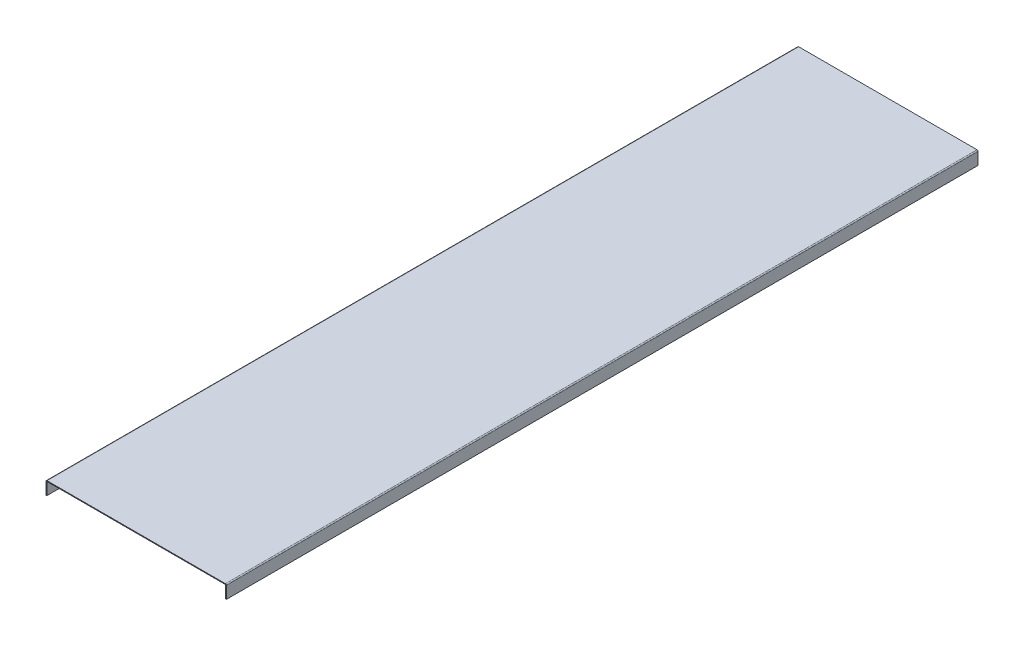
ISO-10303-21;
HEADER;
FILE_DESCRIPTION(('STEP AP214'),'2;1');
FILE_NAME('part.step','',(''),(''),'','','');
FILE_SCHEMA(('AUTOMOTIVE_DESIGN { 1 0 10303 214 1 1 1 1 }'));
ENDSEC;
DATA;
#1=APPLICATION_CONTEXT('core data for automotive mechanical design processes');
#2=APPLICATION_PROTOCOL_DEFINITION('international standard','automotive_design',2000,#1);
#3=PRODUCT_CONTEXT('',#1,'mechanical');
#4=PRODUCT('Part','Part','',(#3));
#5=PRODUCT_RELATED_PRODUCT_CATEGORY('part','',(#4));
#6=PRODUCT_DEFINITION_FORMATION('','',#4);
#7=PRODUCT_DEFINITION_CONTEXT('part definition',#1,'design');
#8=PRODUCT_DEFINITION('design','',#6,#7);
#9=PRODUCT_DEFINITION_SHAPE('','',#8);
#10=(LENGTH_UNIT() NAMED_UNIT(*) SI_UNIT(.MILLI.,.METRE.));
#11=(NAMED_UNIT(*) PLANE_ANGLE_UNIT() SI_UNIT($,.RADIAN.));
#12=(NAMED_UNIT(*) SI_UNIT($,.STERADIAN.) SOLID_ANGLE_UNIT());
#13=UNCERTAINTY_MEASURE_WITH_UNIT(LENGTH_MEASURE(1.E-05),#10,'distance_accuracy_value','');
#14=(GEOMETRIC_REPRESENTATION_CONTEXT(3) GLOBAL_UNCERTAINTY_ASSIGNED_CONTEXT((#13)) GLOBAL_UNIT_ASSIGNED_CONTEXT((#10,
#11,#12)) REPRESENTATION_CONTEXT('',''));
#15=CARTESIAN_POINT('',(0.,0.,0.));
#16=DIRECTION('',(0.,0.,1.));
#17=DIRECTION('',(1.,0.,0.));
#18=AXIS2_PLACEMENT_3D('',#15,#16,#17);
#19=CARTESIAN_POINT('',(-240.,-2.,2000.));
#20=DIRECTION('',(0.,1.,0.));
#21=DIRECTION('',(0.,0.,1.));
#22=AXIS2_PLACEMENT_3D('',#19,#20,#21);
#23=PLANE('',#22);
#24=DIRECTION('',(0.,0.,-1.));
#25=VECTOR('',#24,1.);
#26=CARTESIAN_POINT('',(-237.2634,-2.00000000000002,0.));
#27=LINE('',#26,#25);
#28=CARTESIAN_POINT('',(-237.2634,-2.00000000000002,0.));
#29=VERTEX_POINT('',#28);
#30=CARTESIAN_POINT('',(-237.2634,-2.00000000000002,2000.));
#31=VERTEX_POINT('',#30);
#32=EDGE_CURVE('E224',#29,#31,#27,.F.);
#33=ORIENTED_EDGE('',*,*,#32,.F.);
#34=DIRECTION('',(1.,0.,0.));
#35=VECTOR('',#34,1.);
#36=CARTESIAN_POINT('',(-240.,-2.,0.));
#37=LINE('',#36,#35);
#38=CARTESIAN_POINT('',(237.2634,-1.99999999999999,0.));
#39=VERTEX_POINT('',#38);
#40=EDGE_CURVE('E282',#29,#39,#37,.T.);
#41=ORIENTED_EDGE('',*,*,#40,.T.);
#42=DIRECTION('',(0.,0.,1.));
#43=VECTOR('',#42,1.);
#44=CARTESIAN_POINT('',(237.2634,-1.99999999999999,2000.));
#45=LINE('',#44,#43);
#46=CARTESIAN_POINT('',(237.2634,-1.99999999999999,2000.));
#47=VERTEX_POINT('',#46);
#48=EDGE_CURVE('E276',#47,#39,#45,.F.);
#49=ORIENTED_EDGE('',*,*,#48,.F.);
#50=DIRECTION('',(1.,0.,0.));
#51=VECTOR('',#50,1.);
#52=CARTESIAN_POINT('',(-240.,-2.,2000.));
#53=LINE('',#52,#51);
#54=EDGE_CURVE('E87',#31,#47,#53,.T.);
#55=ORIENTED_EDGE('',*,*,#54,.F.);
#56=EDGE_LOOP('',(#33,#41,#49,#55));
#57=FACE_BOUND('',#56,.T.);
#58=ADVANCED_FACE('F79',(#57),#23,.F.);
#59=CARTESIAN_POINT('',(-240.,0.,2000.));
#60=DIRECTION('',(0.,1.,0.));
#61=DIRECTION('',(0.,0.,1.));
#62=AXIS2_PLACEMENT_3D('',#59,#60,#61);
#63=PLANE('',#62);
#64=DIRECTION('',(1.,0.,0.));
#65=VECTOR('',#64,1.);
#66=CARTESIAN_POINT('',(-240.,0.,0.));
#67=LINE('',#66,#65);
#68=CARTESIAN_POINT('',(-237.2634,0.,0.));
#69=VERTEX_POINT('',#68);
#70=CARTESIAN_POINT('',(237.2634,0.,0.));
#71=VERTEX_POINT('',#70);
#72=EDGE_CURVE('E82',#69,#71,#67,.T.);
#73=ORIENTED_EDGE('',*,*,#72,.F.);
#74=DIRECTION('',(0.,0.,-1.));
#75=VECTOR('',#74,1.);
#76=CARTESIAN_POINT('',(-237.2634,0.,0.));
#77=LINE('',#76,#75);
#78=CARTESIAN_POINT('',(-237.2634,0.,2000.));
#79=VERTEX_POINT('',#78);
#80=EDGE_CURVE('E213',#69,#79,#77,.F.);
#81=ORIENTED_EDGE('',*,*,#80,.T.);
#82=DIRECTION('',(1.,0.,0.));
#83=VECTOR('',#82,1.);
#84=CARTESIAN_POINT('',(-240.,0.,2000.));
#85=LINE('',#84,#83);
#86=CARTESIAN_POINT('',(237.2634,0.,2000.));
#87=VERTEX_POINT('',#86);
#88=EDGE_CURVE('E13',#79,#87,#85,.T.);
#89=ORIENTED_EDGE('',*,*,#88,.T.);
#90=DIRECTION('',(0.,0.,1.));
#91=VECTOR('',#90,1.);
#92=CARTESIAN_POINT('',(237.2634,0.,2000.));
#93=LINE('',#92,#91);
#94=EDGE_CURVE('E265',#87,#71,#93,.F.);
#95=ORIENTED_EDGE('',*,*,#94,.T.);
#96=EDGE_LOOP('',(#73,#81,#89,#95));
#97=FACE_BOUND('',#96,.T.);
#98=ADVANCED_FACE('F297',(#97),#63,.T.);
#99=CARTESIAN_POINT('',(0.,0.,2000.));
#100=DIRECTION('',(0.,0.,-1.));
#101=DIRECTION('',(-1.,0.,0.));
#102=AXIS2_PLACEMENT_3D('',#99,#100,#101);
#103=PLANE('',#102);
#104=DIRECTION('',(0.,1.,0.));
#105=VECTOR('',#104,1.);
#106=CARTESIAN_POINT('',(-237.2634,-2.00000000000002,2000.));
#107=LINE('',#106,#105);
#108=EDGE_CURVE('E228',#31,#79,#107,.T.);
#109=ORIENTED_EDGE('',*,*,#108,.F.);
#110=ORIENTED_EDGE('',*,*,#54,.T.);
#111=DIRECTION('',(0.,1.,0.));
#112=VECTOR('',#111,1.);
#113=CARTESIAN_POINT('',(237.2634,-1.99999999999999,2000.));
#114=LINE('',#113,#112);
#115=EDGE_CURVE('E270',#47,#87,#114,.T.);
#116=ORIENTED_EDGE('',*,*,#115,.T.);
#117=ORIENTED_EDGE('',*,*,#88,.F.);
#118=EDGE_LOOP('',(#109,#110,#116,#117));
#119=FACE_BOUND('',#118,.T.);
#120=ADVANCED_FACE('F341',(#119),#103,.F.);
#121=CARTESIAN_POINT('',(0.,0.,0.));
#122=DIRECTION('',(0.,0.,-1.));
#123=DIRECTION('',(-1.,0.,0.));
#124=AXIS2_PLACEMENT_3D('',#121,#122,#123);
#125=PLANE('',#124);
#126=ORIENTED_EDGE('',*,*,#40,.F.);
#127=DIRECTION('',(0.,1.,0.));
#128=VECTOR('',#127,1.);
#129=CARTESIAN_POINT('',(-237.2634,-2.00000000000002,0.));
#130=LINE('',#129,#128);
#131=EDGE_CURVE('E218',#29,#69,#130,.T.);
#132=ORIENTED_EDGE('',*,*,#131,.T.);
#133=ORIENTED_EDGE('',*,*,#72,.T.);
#134=DIRECTION('',(0.,1.,0.));
#135=VECTOR('',#134,1.);
#136=CARTESIAN_POINT('',(237.2634,-1.99999999999999,0.));
#137=LINE('',#136,#135);
#138=EDGE_CURVE('E280',#39,#71,#137,.T.);
#139=ORIENTED_EDGE('',*,*,#138,.F.);
#140=EDGE_LOOP('',(#126,#132,#133,#139));
#141=FACE_BOUND('',#140,.T.);
#142=ADVANCED_FACE('F295',(#141),#125,.T.);
#143=CARTESIAN_POINT('',(237.2634,-2.73659999999999,0.));
#144=DIRECTION('',(0.,0.,-1.));
#145=DIRECTION('',(-1.,0.,0.));
#146=AXIS2_PLACEMENT_3D('',#143,#144,#145);
#147=PLANE('',#146);
#148=DIRECTION('',(1.,0.,0.));
#149=VECTOR('',#148,1.);
#150=CARTESIAN_POINT('',(240.,-2.7366,0.));
#151=LINE('',#150,#149);
#152=CARTESIAN_POINT('',(238.,-2.73659999999999,0.));
#153=VERTEX_POINT('',#152);
#154=CARTESIAN_POINT('',(240.,-2.73659999999999,0.));
#155=VERTEX_POINT('',#154);
#156=EDGE_CURVE('E230',#153,#155,#151,.T.);
#157=ORIENTED_EDGE('',*,*,#156,.F.);
#158=CARTESIAN_POINT('',(237.2634,-2.73659999999999,0.));
#159=DIRECTION('',(0.,0.,1.));
#160=DIRECTION('',(1.,0.,0.));
#161=AXIS2_PLACEMENT_3D('',#158,#159,#160);
#162=CIRCLE('',#161,0.736600000000004);
#163=EDGE_CURVE('E273',#39,#153,#162,.F.);
#164=ORIENTED_EDGE('',*,*,#163,.F.);
#165=ORIENTED_EDGE('',*,*,#138,.T.);
#166=CARTESIAN_POINT('',(237.2634,-2.73659999999999,0.));
#167=DIRECTION('',(0.,0.,1.));
#168=DIRECTION('',(1.,0.,0.));
#169=AXIS2_PLACEMENT_3D('',#166,#167,#168);
#170=CIRCLE('',#169,2.7366);
#171=EDGE_CURVE('E95',#71,#155,#170,.F.);
#172=ORIENTED_EDGE('',*,*,#171,.T.);
#173=EDGE_LOOP('',(#157,#164,#165,#172));
#174=FACE_BOUND('',#173,.T.);
#175=ADVANCED_FACE('F321',(#174),#147,.T.);
#176=CARTESIAN_POINT('',(237.2634,-2.73659999999999,2000.));
#177=DIRECTION('',(0.,0.,-1.));
#178=DIRECTION('',(-1.,0.,0.));
#179=AXIS2_PLACEMENT_3D('',#176,#177,#178);
#180=PLANE('',#179);
#181=CARTESIAN_POINT('',(237.2634,-2.73659999999999,2000.));
#182=DIRECTION('',(0.,0.,1.));
#183=DIRECTION('',(1.,0.,0.));
#184=AXIS2_PLACEMENT_3D('',#181,#182,#183);
#185=CIRCLE('',#184,0.736600000000004);
#186=CARTESIAN_POINT('',(238.,-2.73659999999999,2000.));
#187=VERTEX_POINT('',#186);
#188=EDGE_CURVE('E235',#187,#47,#185,.T.);
#189=ORIENTED_EDGE('',*,*,#188,.F.);
#190=DIRECTION('',(1.,0.,0.));
#191=VECTOR('',#190,1.);
#192=CARTESIAN_POINT('',(238.,-2.73659999999998,2000.));
#193=LINE('',#192,#191);
#194=CARTESIAN_POINT('',(240.,-2.73659999999997,2000.));
#195=VERTEX_POINT('',#194);
#196=EDGE_CURVE('E258',#187,#195,#193,.T.);
#197=ORIENTED_EDGE('',*,*,#196,.T.);
#198=CARTESIAN_POINT('',(237.2634,-2.73659999999999,2000.));
#199=DIRECTION('',(0.,0.,1.));
#200=DIRECTION('',(1.,0.,0.));
#201=AXIS2_PLACEMENT_3D('',#198,#199,#200);
#202=CIRCLE('',#201,2.7366);
#203=EDGE_CURVE('E268',#195,#87,#202,.T.);
#204=ORIENTED_EDGE('',*,*,#203,.T.);
#205=ORIENTED_EDGE('',*,*,#115,.F.);
#206=EDGE_LOOP('',(#189,#197,#204,#205));
#207=FACE_BOUND('',#206,.T.);
#208=ADVANCED_FACE('F302',(#207),#180,.F.);
#209=CARTESIAN_POINT('',(237.2634,-2.73659999999999,2000.));
#210=DIRECTION('',(0.,0.,1.));
#211=DIRECTION('',(1.,0.,0.));
#212=AXIS2_PLACEMENT_3D('',#209,#210,#211);
#213=CYLINDRICAL_SURFACE('',#212,2.7366);
#214=ORIENTED_EDGE('',*,*,#94,.F.);
#215=ORIENTED_EDGE('',*,*,#203,.F.);
#216=DIRECTION('',(0.,0.,1.));
#217=VECTOR('',#216,1.);
#218=CARTESIAN_POINT('',(240.,-2.7366,0.));
#219=LINE('',#218,#217);
#220=EDGE_CURVE('E255',#155,#195,#219,.T.);
#221=ORIENTED_EDGE('',*,*,#220,.F.);
#222=ORIENTED_EDGE('',*,*,#171,.F.);
#223=EDGE_LOOP('',(#214,#215,#221,#222));
#224=FACE_BOUND('',#223,.T.);
#225=ADVANCED_FACE('F299',(#224),#213,.T.);
#226=CARTESIAN_POINT('',(237.2634,-2.73659999999999,2000.));
#227=DIRECTION('',(0.,0.,1.));
#228=DIRECTION('',(1.,0.,0.));
#229=AXIS2_PLACEMENT_3D('',#226,#227,#228);
#230=CYLINDRICAL_SURFACE('',#229,0.736600000000004);
#231=ORIENTED_EDGE('',*,*,#48,.T.);
#232=ORIENTED_EDGE('',*,*,#163,.T.);
#233=DIRECTION('',(0.,0.,-1.));
#234=VECTOR('',#233,1.);
#235=CARTESIAN_POINT('',(238.,-2.73660000000001,0.));
#236=LINE('',#235,#234);
#237=EDGE_CURVE('E261',#153,#187,#236,.F.);
#238=ORIENTED_EDGE('',*,*,#237,.T.);
#239=ORIENTED_EDGE('',*,*,#188,.T.);
#240=EDGE_LOOP('',(#231,#232,#238,#239));
#241=FACE_BOUND('',#240,.T.);
#242=ADVANCED_FACE('F324',(#241),#230,.F.);
#243=CARTESIAN_POINT('',(240.,-1.99999999999999,2000.));
#244=DIRECTION('',(0.,0.,1.));
#245=DIRECTION('',(1.,0.,0.));
#246=AXIS2_PLACEMENT_3D('',#243,#244,#245);
#247=PLANE('',#246);
#248=DIRECTION('',(0.,1.,0.));
#249=VECTOR('',#248,1.);
#250=CARTESIAN_POINT('',(240.,-1.99999999999999,2000.));
#251=LINE('',#250,#249);
#252=CARTESIAN_POINT('',(240.,-35.,2000.));
#253=VERTEX_POINT('',#252);
#254=EDGE_CURVE('E239',#253,#195,#251,.T.);
#255=ORIENTED_EDGE('',*,*,#254,.T.);
#256=ORIENTED_EDGE('',*,*,#196,.F.);
#257=DIRECTION('',(0.,-1.,0.));
#258=VECTOR('',#257,1.);
#259=CARTESIAN_POINT('',(238.,8.07434927000114E-13,2000.));
#260=LINE('',#259,#258);
#261=CARTESIAN_POINT('',(238.,-35.,2000.));
#262=VERTEX_POINT('',#261);
#263=EDGE_CURVE('E247',#262,#187,#260,.F.);
#264=ORIENTED_EDGE('',*,*,#263,.F.);
#265=DIRECTION('',(-1.,0.,0.));
#266=VECTOR('',#265,1.);
#267=CARTESIAN_POINT('',(240.,-35.,2000.));
#268=LINE('',#267,#266);
#269=EDGE_CURVE('E233',#253,#262,#268,.T.);
#270=ORIENTED_EDGE('',*,*,#269,.F.);
#271=EDGE_LOOP('',(#255,#256,#264,#270));
#272=FACE_BOUND('',#271,.T.);
#273=ADVANCED_FACE('F311',(#272),#247,.T.);
#274=CARTESIAN_POINT('',(240.,-35.,0.));
#275=DIRECTION('',(0.,0.,-1.));
#276=DIRECTION('',(-1.,0.,0.));
#277=AXIS2_PLACEMENT_3D('',#274,#275,#276);
#278=PLANE('',#277);
#279=DIRECTION('',(0.,1.,0.));
#280=VECTOR('',#279,1.);
#281=CARTESIAN_POINT('',(238.,8.07434927000114E-13,0.));
#282=LINE('',#281,#280);
#283=CARTESIAN_POINT('',(238.,-35.,0.));
#284=VERTEX_POINT('',#283);
#285=EDGE_CURVE('E253',#153,#284,#282,.F.);
#286=ORIENTED_EDGE('',*,*,#285,.F.);
#287=ORIENTED_EDGE('',*,*,#156,.T.);
#288=DIRECTION('',(0.,-1.,0.));
#289=VECTOR('',#288,1.);
#290=CARTESIAN_POINT('',(240.,-35.,0.));
#291=LINE('',#290,#289);
#292=CARTESIAN_POINT('',(240.,-35.,0.));
#293=VERTEX_POINT('',#292);
#294=EDGE_CURVE('E245',#155,#293,#291,.T.);
#295=ORIENTED_EDGE('',*,*,#294,.T.);
#296=DIRECTION('',(-1.,0.,0.));
#297=VECTOR('',#296,1.);
#298=CARTESIAN_POINT('',(240.,-35.,0.));
#299=LINE('',#298,#297);
#300=EDGE_CURVE('E236',#293,#284,#299,.T.);
#301=ORIENTED_EDGE('',*,*,#300,.T.);
#302=EDGE_LOOP('',(#286,#287,#295,#301));
#303=FACE_BOUND('',#302,.T.);
#304=ADVANCED_FACE('F318',(#303),#278,.T.);
#305=CARTESIAN_POINT('',(240.,8.144178896778E-13,0.));
#306=DIRECTION('',(1.,0.,0.));
#307=DIRECTION('',(0.,1.,0.));
#308=AXIS2_PLACEMENT_3D('',#305,#306,#307);
#309=PLANE('',#308);
#310=ORIENTED_EDGE('',*,*,#294,.F.);
#311=ORIENTED_EDGE('',*,*,#220,.T.);
#312=ORIENTED_EDGE('',*,*,#254,.F.);
#313=DIRECTION('',(0.,0.,1.));
#314=VECTOR('',#313,1.);
#315=CARTESIAN_POINT('',(240.,-35.,2000.));
#316=LINE('',#315,#314);
#317=EDGE_CURVE('E242',#293,#253,#316,.T.);
#318=ORIENTED_EDGE('',*,*,#317,.F.);
#319=EDGE_LOOP('',(#310,#311,#312,#318));
#320=FACE_BOUND('',#319,.T.);
#321=ADVANCED_FACE('F309',(#320),#309,.T.);
#322=CARTESIAN_POINT('',(238.,8.07434927000114E-13,0.));
#323=DIRECTION('',(1.,0.,0.));
#324=DIRECTION('',(0.,1.,0.));
#325=AXIS2_PLACEMENT_3D('',#322,#323,#324);
#326=PLANE('',#325);
#327=ORIENTED_EDGE('',*,*,#237,.F.);
#328=ORIENTED_EDGE('',*,*,#285,.T.);
#329=DIRECTION('',(0.,0.,-1.));
#330=VECTOR('',#329,1.);
#331=CARTESIAN_POINT('',(238.,-35.,0.));
#332=LINE('',#331,#330);
#333=EDGE_CURVE('E250',#284,#262,#332,.F.);
#334=ORIENTED_EDGE('',*,*,#333,.T.);
#335=ORIENTED_EDGE('',*,*,#263,.T.);
#336=EDGE_LOOP('',(#327,#328,#334,#335));
#337=FACE_BOUND('',#336,.T.);
#338=ADVANCED_FACE('F326',(#337),#326,.F.);
#339=CARTESIAN_POINT('',(240.,-35.,2000.));
#340=DIRECTION('',(0.,-1.,0.));
#341=DIRECTION('',(1.,0.,0.));
#342=AXIS2_PLACEMENT_3D('',#339,#340,#341);
#343=PLANE('',#342);
#344=ORIENTED_EDGE('',*,*,#333,.F.);
#345=ORIENTED_EDGE('',*,*,#300,.F.);
#346=ORIENTED_EDGE('',*,*,#317,.T.);
#347=ORIENTED_EDGE('',*,*,#269,.T.);
#348=EDGE_LOOP('',(#344,#345,#346,#347));
#349=FACE_BOUND('',#348,.T.);
#350=ADVANCED_FACE('F315',(#349),#343,.T.);
#351=CARTESIAN_POINT('',(-237.2634,-2.73660000000002,2000.));
#352=DIRECTION('',(0.,0.,1.));
#353=DIRECTION('',(1.,0.,0.));
#354=AXIS2_PLACEMENT_3D('',#351,#352,#353);
#355=PLANE('',#354);
#356=DIRECTION('',(-1.,0.,0.));
#357=VECTOR('',#356,1.);
#358=CARTESIAN_POINT('',(-240.,-2.7366,2000.));
#359=LINE('',#358,#357);
#360=CARTESIAN_POINT('',(-238.,-2.73660000000002,2000.));
#361=VERTEX_POINT('',#360);
#362=CARTESIAN_POINT('',(-240.,-2.73660000000001,2000.));
#363=VERTEX_POINT('',#362);
#364=EDGE_CURVE('E210',#361,#363,#359,.T.);
#365=ORIENTED_EDGE('',*,*,#364,.F.);
#366=CARTESIAN_POINT('',(-237.2634,-2.73660000000002,2000.));
#367=DIRECTION('',(0.,0.,-1.));
#368=DIRECTION('',(-1.,0.,0.));
#369=AXIS2_PLACEMENT_3D('',#366,#367,#368);
#370=CIRCLE('',#369,0.736600000000004);
#371=EDGE_CURVE('E221',#31,#361,#370,.F.);
#372=ORIENTED_EDGE('',*,*,#371,.F.);
#373=ORIENTED_EDGE('',*,*,#108,.T.);
#374=CARTESIAN_POINT('',(-237.2634,-2.73660000000002,2000.));
#375=DIRECTION('',(0.,0.,-1.));
#376=DIRECTION('',(-1.,0.,0.));
#377=AXIS2_PLACEMENT_3D('',#374,#375,#376);
#378=CIRCLE('',#377,2.7366);
#379=EDGE_CURVE('E103',#79,#363,#378,.F.);
#380=ORIENTED_EDGE('',*,*,#379,.T.);
#381=EDGE_LOOP('',(#365,#372,#373,#380));
#382=FACE_BOUND('',#381,.T.);
#383=ADVANCED_FACE('F333',(#382),#355,.T.);
#384=CARTESIAN_POINT('',(-237.2634,-2.73660000000002,0.));
#385=DIRECTION('',(0.,0.,1.));
#386=DIRECTION('',(1.,0.,0.));
#387=AXIS2_PLACEMENT_3D('',#384,#385,#386);
#388=PLANE('',#387);
#389=CARTESIAN_POINT('',(-237.2634,-2.73660000000002,0.));
#390=DIRECTION('',(0.,0.,-1.));
#391=DIRECTION('',(-1.,0.,0.));
#392=AXIS2_PLACEMENT_3D('',#389,#390,#391);
#393=CIRCLE('',#392,0.736600000000004);
#394=CARTESIAN_POINT('',(-238.,-2.73660000000002,0.));
#395=VERTEX_POINT('',#394);
#396=EDGE_CURVE('E180',#395,#29,#393,.T.);
#397=ORIENTED_EDGE('',*,*,#396,.F.);
#398=DIRECTION('',(-1.,0.,0.));
#399=VECTOR('',#398,1.);
#400=CARTESIAN_POINT('',(-238.,-2.73660000000003,0.));
#401=LINE('',#400,#399);
#402=CARTESIAN_POINT('',(-240.,-2.73660000000003,0.));
#403=VERTEX_POINT('',#402);
#404=EDGE_CURVE('E205',#395,#403,#401,.T.);
#405=ORIENTED_EDGE('',*,*,#404,.T.);
#406=CARTESIAN_POINT('',(-237.2634,-2.73660000000002,0.));
#407=DIRECTION('',(0.,0.,-1.));
#408=DIRECTION('',(-1.,0.,0.));
#409=AXIS2_PLACEMENT_3D('',#406,#407,#408);
#410=CIRCLE('',#409,2.7366);
#411=EDGE_CURVE('E216',#403,#69,#410,.T.);
#412=ORIENTED_EDGE('',*,*,#411,.T.);
#413=ORIENTED_EDGE('',*,*,#131,.F.);
#414=EDGE_LOOP('',(#397,#405,#412,#413));
#415=FACE_BOUND('',#414,.T.);
#416=ADVANCED_FACE('F402',(#415),#388,.F.);
#417=CARTESIAN_POINT('',(-237.2634,-2.73660000000002,0.));
#418=DIRECTION('',(0.,0.,-1.));
#419=DIRECTION('',(-1.,0.,0.));
#420=AXIS2_PLACEMENT_3D('',#417,#418,#419);
#421=CYLINDRICAL_SURFACE('',#420,2.7366);
#422=ORIENTED_EDGE('',*,*,#80,.F.);
#423=ORIENTED_EDGE('',*,*,#411,.F.);
#424=DIRECTION('',(0.,0.,-1.));
#425=VECTOR('',#424,1.);
#426=CARTESIAN_POINT('',(-240.,-2.7366,2000.));
#427=LINE('',#426,#425);
#428=EDGE_CURVE('E189',#403,#363,#427,.F.);
#429=ORIENTED_EDGE('',*,*,#428,.T.);
#430=ORIENTED_EDGE('',*,*,#379,.F.);
#431=EDGE_LOOP('',(#422,#423,#429,#430));
#432=FACE_BOUND('',#431,.T.);
#433=ADVANCED_FACE('F412',(#432),#421,.T.);
#434=CARTESIAN_POINT('',(-237.2634,-2.73660000000002,0.));
#435=DIRECTION('',(0.,0.,-1.));
#436=DIRECTION('',(-1.,0.,0.));
#437=AXIS2_PLACEMENT_3D('',#434,#435,#436);
#438=CYLINDRICAL_SURFACE('',#437,0.736600000000004);
#439=ORIENTED_EDGE('',*,*,#32,.T.);
#440=ORIENTED_EDGE('',*,*,#371,.T.);
#441=DIRECTION('',(0.,0.,-1.));
#442=VECTOR('',#441,1.);
#443=CARTESIAN_POINT('',(-238.,-2.73660000000001,2000.));
#444=LINE('',#443,#442);
#445=EDGE_CURVE('E208',#361,#395,#444,.T.);
#446=ORIENTED_EDGE('',*,*,#445,.T.);
#447=ORIENTED_EDGE('',*,*,#396,.T.);
#448=EDGE_LOOP('',(#439,#440,#446,#447));
#449=FACE_BOUND('',#448,.T.);
#450=ADVANCED_FACE('F345',(#449),#438,.F.);
#451=CARTESIAN_POINT('',(-240.,-1.99999999999999,2000.));
#452=DIRECTION('',(0.,0.,1.));
#453=DIRECTION('',(1.,0.,0.));
#454=AXIS2_PLACEMENT_3D('',#451,#452,#453);
#455=PLANE('',#454);
#456=DIRECTION('',(0.,-1.,0.));
#457=VECTOR('',#456,1.);
#458=CARTESIAN_POINT('',(-238.,8.07434927000114E-13,2000.));
#459=LINE('',#458,#457);
#460=CARTESIAN_POINT('',(-238.,-35.,2000.));
#461=VERTEX_POINT('',#460);
#462=EDGE_CURVE('E202',#361,#461,#459,.T.);
#463=ORIENTED_EDGE('',*,*,#462,.F.);
#464=ORIENTED_EDGE('',*,*,#364,.T.);
#465=DIRECTION('',(0.,1.,0.));
#466=VECTOR('',#465,1.);
#467=CARTESIAN_POINT('',(-240.,-1.99999999999999,2000.));
#468=LINE('',#467,#466);
#469=CARTESIAN_POINT('',(-240.,-35.,2000.));
#470=VERTEX_POINT('',#469);
#471=EDGE_CURVE('E194',#363,#470,#468,.F.);
#472=ORIENTED_EDGE('',*,*,#471,.T.);
#473=DIRECTION('',(1.,0.,0.));
#474=VECTOR('',#473,1.);
#475=CARTESIAN_POINT('',(-240.,-35.,2000.));
#476=LINE('',#475,#474);
#477=EDGE_CURVE('E181',#470,#461,#476,.T.);
#478=ORIENTED_EDGE('',*,*,#477,.T.);
#479=EDGE_LOOP('',(#463,#464,#472,#478));
#480=FACE_BOUND('',#479,.T.);
#481=ADVANCED_FACE('F432',(#480),#455,.T.);
#482=CARTESIAN_POINT('',(-240.,-35.,0.));
#483=DIRECTION('',(0.,0.,-1.));
#484=DIRECTION('',(-1.,0.,0.));
#485=AXIS2_PLACEMENT_3D('',#482,#483,#484);
#486=PLANE('',#485);
#487=DIRECTION('',(0.,-1.,0.));
#488=VECTOR('',#487,1.);
#489=CARTESIAN_POINT('',(-240.,-35.,0.));
#490=LINE('',#489,#488);
#491=CARTESIAN_POINT('',(-240.,-35.,0.));
#492=VERTEX_POINT('',#491);
#493=EDGE_CURVE('E173',#492,#403,#490,.F.);
#494=ORIENTED_EDGE('',*,*,#493,.T.);
#495=ORIENTED_EDGE('',*,*,#404,.F.);
#496=DIRECTION('',(0.,1.,0.));
#497=VECTOR('',#496,1.);
#498=CARTESIAN_POINT('',(-238.,8.07434927000114E-13,0.));
#499=LINE('',#498,#497);
#500=CARTESIAN_POINT('',(-238.,-35.,0.));
#501=VERTEX_POINT('',#500);
#502=EDGE_CURVE('E175',#501,#395,#499,.T.);
#503=ORIENTED_EDGE('',*,*,#502,.F.);
#504=DIRECTION('',(1.,0.,0.));
#505=VECTOR('',#504,1.);
#506=CARTESIAN_POINT('',(-240.,-35.,0.));
#507=LINE('',#506,#505);
#508=EDGE_CURVE('E169',#492,#501,#507,.T.);
#509=ORIENTED_EDGE('',*,*,#508,.F.);
#510=EDGE_LOOP('',(#494,#495,#503,#509));
#511=FACE_BOUND('',#510,.T.);
#512=ADVANCED_FACE('F171',(#511),#486,.T.);
#513=CARTESIAN_POINT('',(-240.,8.144178896778E-13,0.));
#514=DIRECTION('',(1.,0.,0.));
#515=DIRECTION('',(0.,1.,0.));
#516=AXIS2_PLACEMENT_3D('',#513,#514,#515);
#517=PLANE('',#516);
#518=ORIENTED_EDGE('',*,*,#428,.F.);
#519=ORIENTED_EDGE('',*,*,#493,.F.);
#520=DIRECTION('',(0.,0.,1.));
#521=VECTOR('',#520,1.);
#522=CARTESIAN_POINT('',(-240.,-35.,2000.));
#523=LINE('',#522,#521);
#524=EDGE_CURVE('E188',#470,#492,#523,.F.);
#525=ORIENTED_EDGE('',*,*,#524,.F.);
#526=ORIENTED_EDGE('',*,*,#471,.F.);
#527=EDGE_LOOP('',(#518,#519,#525,#526));
#528=FACE_BOUND('',#527,.T.);
#529=ADVANCED_FACE('F186',(#528),#517,.F.);
#530=CARTESIAN_POINT('',(-238.,8.07434927000114E-13,0.));
#531=DIRECTION('',(1.,0.,0.));
#532=DIRECTION('',(0.,1.,0.));
#533=AXIS2_PLACEMENT_3D('',#530,#531,#532);
#534=PLANE('',#533);
#535=ORIENTED_EDGE('',*,*,#502,.T.);
#536=ORIENTED_EDGE('',*,*,#445,.F.);
#537=ORIENTED_EDGE('',*,*,#462,.T.);
#538=DIRECTION('',(0.,0.,-1.));
#539=VECTOR('',#538,1.);
#540=CARTESIAN_POINT('',(-238.,-35.,0.));
#541=LINE('',#540,#539);
#542=EDGE_CURVE('E200',#461,#501,#541,.T.);
#543=ORIENTED_EDGE('',*,*,#542,.T.);
#544=EDGE_LOOP('',(#535,#536,#537,#543));
#545=FACE_BOUND('',#544,.T.);
#546=ADVANCED_FACE('F461',(#545),#534,.T.);
#547=CARTESIAN_POINT('',(-240.,-35.,2000.));
#548=DIRECTION('',(0.,-1.,0.));
#549=DIRECTION('',(1.,0.,0.));
#550=AXIS2_PLACEMENT_3D('',#547,#548,#549);
#551=PLANE('',#550);
#552=ORIENTED_EDGE('',*,*,#542,.F.);
#553=ORIENTED_EDGE('',*,*,#477,.F.);
#554=ORIENTED_EDGE('',*,*,#524,.T.);
#555=ORIENTED_EDGE('',*,*,#508,.T.);
#556=EDGE_LOOP('',(#552,#553,#554,#555));
#557=FACE_BOUND('',#556,.T.);
#558=ADVANCED_FACE('F192',(#557),#551,.T.);
#559=CLOSED_SHELL('',(#58,#98,#120,#142,#175,#208,#225,#242,#273,#304,#321,#338,#350,#383,#416,
#433,#450,#481,#512,#529,#546,#558));
#560=MANIFOLD_SOLID_BREP('B2',#559);
#561=ADVANCED_BREP_SHAPE_REPRESENTATION('',(#18,#560),#14);
#562=SHAPE_DEFINITION_REPRESENTATION(#9,#561);
ENDSEC;
END-ISO-10303-21;
